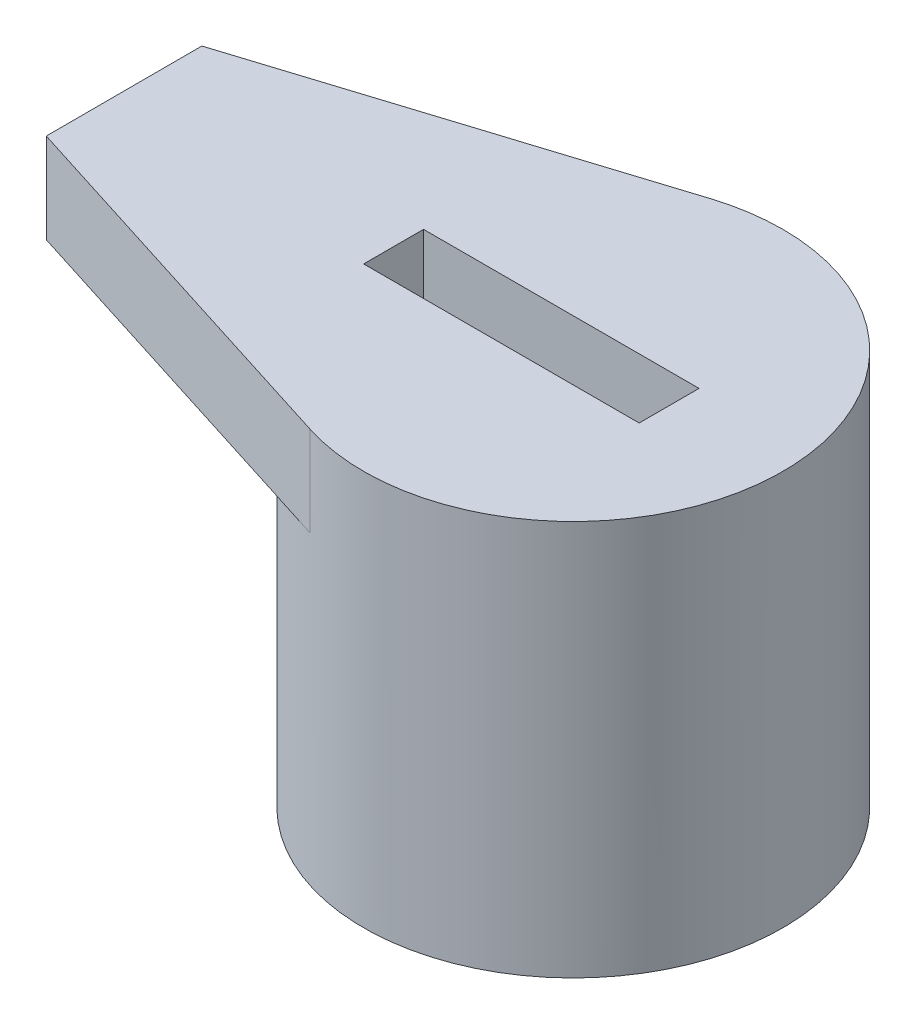
ISO-10303-21;
HEADER;
FILE_DESCRIPTION(('STEP AP214'),'2;1');
FILE_NAME('part.step','',(''),(''),'','','');
FILE_SCHEMA(('AUTOMOTIVE_DESIGN { 1 0 10303 214 1 1 1 1 }'));
ENDSEC;
DATA;
#1=APPLICATION_CONTEXT('core data for automotive mechanical design processes');
#2=APPLICATION_PROTOCOL_DEFINITION('international standard','automotive_design',2000,#1);
#3=PRODUCT_CONTEXT('',#1,'mechanical');
#4=PRODUCT('Part','Part','',(#3));
#5=PRODUCT_RELATED_PRODUCT_CATEGORY('part','',(#4));
#6=PRODUCT_DEFINITION_FORMATION('','',#4);
#7=PRODUCT_DEFINITION_CONTEXT('part definition',#1,'design');
#8=PRODUCT_DEFINITION('design','',#6,#7);
#9=PRODUCT_DEFINITION_SHAPE('','',#8);
#10=(LENGTH_UNIT() NAMED_UNIT(*) SI_UNIT(.MILLI.,.METRE.));
#11=(NAMED_UNIT(*) PLANE_ANGLE_UNIT() SI_UNIT($,.RADIAN.));
#12=(NAMED_UNIT(*) SI_UNIT($,.STERADIAN.) SOLID_ANGLE_UNIT());
#13=UNCERTAINTY_MEASURE_WITH_UNIT(LENGTH_MEASURE(1.E-05),#10,'distance_accuracy_value','');
#14=(GEOMETRIC_REPRESENTATION_CONTEXT(3) GLOBAL_UNCERTAINTY_ASSIGNED_CONTEXT((#13)) GLOBAL_UNIT_ASSIGNED_CONTEXT((#10,
#11,#12)) REPRESENTATION_CONTEXT('',''));
#15=CARTESIAN_POINT('',(0.,0.,0.));
#16=DIRECTION('',(0.,0.,1.));
#17=DIRECTION('',(1.,0.,0.));
#18=AXIS2_PLACEMENT_3D('',#15,#16,#17);
#19=CARTESIAN_POINT('',(-5.86092041698449,20.9504195270786,-34.));
#20=DIRECTION('',(0.,1.,0.));
#21=DIRECTION('',(0.,0.,1.));
#22=AXIS2_PLACEMENT_3D('',#19,#20,#21);
#23=PLANE('',#22);
#24=DIRECTION('',(0.,0.,-1.));
#25=VECTOR('',#24,1.);
#26=CARTESIAN_POINT('',(-4.26092041698449,20.9504195270786,-33.5));
#27=LINE('',#26,#25);
#28=CARTESIAN_POINT('',(-4.26092041698449,20.9504195270786,-33.5));
#29=VERTEX_POINT('',#28);
#30=CARTESIAN_POINT('',(-4.26092041698449,20.9504195270786,-34.5));
#31=VERTEX_POINT('',#30);
#32=EDGE_CURVE('E93',#29,#31,#27,.T.);
#33=ORIENTED_EDGE('',*,*,#32,.T.);
#34=DIRECTION('',(-1.,0.,0.));
#35=VECTOR('',#34,1.);
#36=CARTESIAN_POINT('',(-4.26092041698449,20.9504195270786,-34.5));
#37=LINE('',#36,#35);
#38=CARTESIAN_POINT('',(-8.86092041698449,20.9504195270786,-34.5));
#39=VERTEX_POINT('',#38);
#40=EDGE_CURVE('E95',#31,#39,#37,.T.);
#41=ORIENTED_EDGE('',*,*,#40,.T.);
#42=DIRECTION('',(0.,0.,1.));
#43=VECTOR('',#42,1.);
#44=CARTESIAN_POINT('',(-8.86092041698449,20.9504195270786,-33.5));
#45=LINE('',#44,#43);
#46=CARTESIAN_POINT('',(-8.86092041698449,20.9504195270786,-33.5));
#47=VERTEX_POINT('',#46);
#48=EDGE_CURVE('E97',#39,#47,#45,.T.);
#49=ORIENTED_EDGE('',*,*,#48,.T.);
#50=DIRECTION('',(1.,0.,0.));
#51=VECTOR('',#50,1.);
#52=CARTESIAN_POINT('',(-4.26092041698449,20.9504195270786,-33.5));
#53=LINE('',#52,#51);
#54=EDGE_CURVE('E168',#47,#29,#53,.T.);
#55=ORIENTED_EDGE('',*,*,#54,.T.);
#56=EDGE_LOOP('',(#33,#41,#49,#55));
#57=FACE_BOUND('',#56,.T.);
#58=ADVANCED_FACE('F18',(#57),#23,.T.);
#59=CARTESIAN_POINT('',(-8.86092041698449,20.9504195270786,-33.5));
#60=DIRECTION('',(-1.,0.,0.));
#61=DIRECTION('',(0.,0.,1.));
#62=AXIS2_PLACEMENT_3D('',#59,#60,#61);
#63=PLANE('',#62);
#64=ORIENTED_EDGE('',*,*,#48,.F.);
#65=DIRECTION('',(0.,1.,0.));
#66=VECTOR('',#65,1.);
#67=CARTESIAN_POINT('',(-8.86092041698449,20.9504195270786,-34.5));
#68=LINE('',#67,#66);
#69=CARTESIAN_POINT('',(-8.86092041698449,22.4504195270786,-34.5));
#70=VERTEX_POINT('',#69);
#71=EDGE_CURVE('E102',#39,#70,#68,.T.);
#72=ORIENTED_EDGE('',*,*,#71,.T.);
#73=DIRECTION('',(0.,0.,1.));
#74=VECTOR('',#73,1.);
#75=CARTESIAN_POINT('',(-8.86092041698449,22.4504195270786,-34.));
#76=LINE('',#75,#74);
#77=CARTESIAN_POINT('',(-8.86092041698449,22.4504195270786,-33.5));
#78=VERTEX_POINT('',#77);
#79=EDGE_CURVE('E78',#78,#70,#76,.F.);
#80=ORIENTED_EDGE('',*,*,#79,.F.);
#81=DIRECTION('',(0.,-1.,0.));
#82=VECTOR('',#81,1.);
#83=CARTESIAN_POINT('',(-8.86092041698449,20.9504195270786,-33.5));
#84=LINE('',#83,#82);
#85=EDGE_CURVE('E106',#78,#47,#84,.T.);
#86=ORIENTED_EDGE('',*,*,#85,.T.);
#87=EDGE_LOOP('',(#64,#72,#80,#86));
#88=FACE_BOUND('',#87,.T.);
#89=ADVANCED_FACE('F104',(#88),#63,.F.);
#90=CARTESIAN_POINT('',(-4.26092041698449,20.9504195270786,-34.5));
#91=DIRECTION('',(0.,0.,-1.));
#92=DIRECTION('',(-1.,0.,0.));
#93=AXIS2_PLACEMENT_3D('',#90,#91,#92);
#94=PLANE('',#93);
#95=ORIENTED_EDGE('',*,*,#40,.F.);
#96=DIRECTION('',(0.,1.,0.));
#97=VECTOR('',#96,1.);
#98=CARTESIAN_POINT('',(-4.26092041698449,20.9504195270786,-34.5));
#99=LINE('',#98,#97);
#100=CARTESIAN_POINT('',(-4.26092041698449,22.4504195270786,-34.5));
#101=VERTEX_POINT('',#100);
#102=EDGE_CURVE('E113',#31,#101,#99,.T.);
#103=ORIENTED_EDGE('',*,*,#102,.T.);
#104=DIRECTION('',(1.,0.,0.));
#105=VECTOR('',#104,1.);
#106=CARTESIAN_POINT('',(-5.86092041698449,22.4504195270786,-34.5));
#107=LINE('',#106,#105);
#108=EDGE_CURVE('E111',#70,#101,#107,.T.);
#109=ORIENTED_EDGE('',*,*,#108,.F.);
#110=ORIENTED_EDGE('',*,*,#71,.F.);
#111=EDGE_LOOP('',(#95,#103,#109,#110));
#112=FACE_BOUND('',#111,.T.);
#113=ADVANCED_FACE('F109',(#112),#94,.F.);
#114=CARTESIAN_POINT('',(-4.26092041698449,20.9504195270786,-33.5));
#115=DIRECTION('',(1.,0.,0.));
#116=DIRECTION('',(0.,0.,-1.));
#117=AXIS2_PLACEMENT_3D('',#114,#115,#116);
#118=PLANE('',#117);
#119=ORIENTED_EDGE('',*,*,#32,.F.);
#120=DIRECTION('',(0.,-1.,0.));
#121=VECTOR('',#120,1.);
#122=CARTESIAN_POINT('',(-4.26092041698449,20.9504195270786,-33.5));
#123=LINE('',#122,#121);
#124=CARTESIAN_POINT('',(-4.26092041698449,22.4504195270786,-33.5));
#125=VERTEX_POINT('',#124);
#126=EDGE_CURVE('E164',#29,#125,#123,.F.);
#127=ORIENTED_EDGE('',*,*,#126,.T.);
#128=DIRECTION('',(0.,0.,1.));
#129=VECTOR('',#128,1.);
#130=CARTESIAN_POINT('',(-4.26092041698449,22.4504195270786,-34.));
#131=LINE('',#130,#129);
#132=EDGE_CURVE('E141',#101,#125,#131,.T.);
#133=ORIENTED_EDGE('',*,*,#132,.F.);
#134=ORIENTED_EDGE('',*,*,#102,.F.);
#135=EDGE_LOOP('',(#119,#127,#133,#134));
#136=FACE_BOUND('',#135,.T.);
#137=ADVANCED_FACE('F172',(#136),#118,.F.);
#138=CARTESIAN_POINT('',(-4.26092041698449,20.9504195270786,-33.5));
#139=DIRECTION('',(0.,0.,1.));
#140=DIRECTION('',(0.,-1.,0.));
#141=AXIS2_PLACEMENT_3D('',#138,#139,#140);
#142=PLANE('',#141);
#143=ORIENTED_EDGE('',*,*,#54,.F.);
#144=ORIENTED_EDGE('',*,*,#85,.F.);
#145=DIRECTION('',(1.,0.,0.));
#146=VECTOR('',#145,1.);
#147=CARTESIAN_POINT('',(-5.86092041698449,22.4504195270786,-33.5));
#148=LINE('',#147,#146);
#149=EDGE_CURVE('E138',#125,#78,#148,.F.);
#150=ORIENTED_EDGE('',*,*,#149,.F.);
#151=ORIENTED_EDGE('',*,*,#126,.F.);
#152=EDGE_LOOP('',(#143,#144,#150,#151));
#153=FACE_BOUND('',#152,.T.);
#154=ADVANCED_FACE('F179',(#153),#142,.F.);
#155=CARTESIAN_POINT('',(-13.3593221713242,22.4504195270786,-32.7));
#156=DIRECTION('',(0.999999238856131,0.,-0.00123381001756133));
#157=DIRECTION('',(-0.00123381001756133,0.,-0.999999238856131));
#158=AXIS2_PLACEMENT_3D('',#155,#156,#157);
#159=PLANE('',#158);
#160=DIRECTION('',(0.00123381001756254,0.,0.999999238856131));
#161=VECTOR('',#160,1.);
#162=CARTESIAN_POINT('',(-13.3625300798115,22.4504195270786,-35.3));
#163=LINE('',#162,#161);
#164=CARTESIAN_POINT('',(-13.3625300798115,22.4504195270786,-35.3));
#165=VERTEX_POINT('',#164);
#166=CARTESIAN_POINT('',(-13.3593221713242,22.4504195270786,-32.7));
#167=VERTEX_POINT('',#166);
#168=EDGE_CURVE('E117',#165,#167,#163,.T.);
#169=ORIENTED_EDGE('',*,*,#168,.F.);
#170=DIRECTION('',(0.,1.,0.));
#171=VECTOR('',#170,1.);
#172=CARTESIAN_POINT('',(-13.3625300798115,22.4504195270786,-35.3));
#173=LINE('',#172,#171);
#174=CARTESIAN_POINT('',(-13.3625300798115,20.9504195270786,-35.3));
#175=VERTEX_POINT('',#174);
#176=EDGE_CURVE('E57',#165,#175,#173,.F.);
#177=ORIENTED_EDGE('',*,*,#176,.T.);
#178=DIRECTION('',(0.00123381001756255,0.,0.999999238856131));
#179=VECTOR('',#178,1.);
#180=CARTESIAN_POINT('',(-13.3625300798115,20.9504195270786,-35.3));
#181=LINE('',#180,#179);
#182=CARTESIAN_POINT('',(-13.3593221713242,20.9504195270786,-32.7));
#183=VERTEX_POINT('',#182);
#184=EDGE_CURVE('E51',#175,#183,#181,.T.);
#185=ORIENTED_EDGE('',*,*,#184,.T.);
#186=DIRECTION('',(0.,1.,0.));
#187=VECTOR('',#186,1.);
#188=CARTESIAN_POINT('',(-13.3593221713242,22.4504195270786,-32.7));
#189=LINE('',#188,#187);
#190=EDGE_CURVE('E69',#183,#167,#189,.T.);
#191=ORIENTED_EDGE('',*,*,#190,.T.);
#192=EDGE_LOOP('',(#169,#177,#185,#191));
#193=FACE_BOUND('',#192,.T.);
#194=ADVANCED_FACE('F181',(#193),#159,.F.);
#195=CARTESIAN_POINT('',(-13.3593221713242,22.4504195270786,-32.7));
#196=DIRECTION('',(0.301461317205613,0.,-0.95347840784606));
#197=DIRECTION('',(-0.95347840784606,0.,-0.301461317205613));
#198=AXIS2_PLACEMENT_3D('',#195,#196,#197);
#199=PLANE('',#198);
#200=DIRECTION('',(0.95347840784606,0.,0.301461317205611));
#201=VECTOR('',#200,1.);
#202=CARTESIAN_POINT('',(-13.3593221713242,22.4504195270786,-32.7));
#203=LINE('',#202,#201);
#204=CARTESIAN_POINT('',(-6.91603502720413,22.4504195270786,-30.6628255725388));
#205=VERTEX_POINT('',#204);
#206=EDGE_CURVE('E120',#167,#205,#203,.T.);
#207=ORIENTED_EDGE('',*,*,#206,.F.);
#208=ORIENTED_EDGE('',*,*,#190,.F.);
#209=DIRECTION('',(0.95347840784606,0.,0.301461317205611));
#210=VECTOR('',#209,1.);
#211=CARTESIAN_POINT('',(-13.3593221713242,20.9504195270786,-32.7));
#212=LINE('',#211,#210);
#213=CARTESIAN_POINT('',(-6.91603502720413,20.9504195270786,-30.6628255725388));
#214=VERTEX_POINT('',#213);
#215=EDGE_CURVE('E128',#183,#214,#212,.T.);
#216=ORIENTED_EDGE('',*,*,#215,.T.);
#217=DIRECTION('',(0.,1.,0.));
#218=VECTOR('',#217,1.);
#219=CARTESIAN_POINT('',(-6.91603502720414,22.4504195270786,-30.6628255725388));
#220=LINE('',#219,#218);
#221=EDGE_CURVE('E35',#205,#214,#220,.F.);
#222=ORIENTED_EDGE('',*,*,#221,.F.);
#223=EDGE_LOOP('',(#207,#208,#216,#222));
#224=FACE_BOUND('',#223,.T.);
#225=ADVANCED_FACE('F188',(#224),#199,.F.);
#226=CARTESIAN_POINT('',(-13.3625300798115,22.4504195270786,-35.3));
#227=DIRECTION('',(0.301324932706972,0.,0.953521517811286));
#228=DIRECTION('',(0.953521517811286,0.,-0.301324932706972));
#229=AXIS2_PLACEMENT_3D('',#226,#227,#228);
#230=PLANE('',#229);
#231=DIRECTION('',(-0.953521517811285,0.,0.301324932706974));
#232=VECTOR('',#231,1.);
#233=CARTESIAN_POINT('',(-6.91555768145889,22.4504195270786,-37.3373253123395));
#234=LINE('',#233,#232);
#235=CARTESIAN_POINT('',(-6.91555768145889,22.4504195270786,-37.3373253123395));
#236=VERTEX_POINT('',#235);
#237=EDGE_CURVE('E121',#236,#165,#234,.T.);
#238=ORIENTED_EDGE('',*,*,#237,.F.);
#239=DIRECTION('',(0.,-1.,0.));
#240=VECTOR('',#239,1.);
#241=CARTESIAN_POINT('',(-6.91555768145889,15.8504195270786,-37.3373253123395));
#242=LINE('',#241,#240);
#243=CARTESIAN_POINT('',(-6.9155576814589,20.9504195270786,-37.3373253123395));
#244=VERTEX_POINT('',#243);
#245=EDGE_CURVE('E152',#244,#236,#242,.F.);
#246=ORIENTED_EDGE('',*,*,#245,.F.);
#247=DIRECTION('',(-0.953521517811285,0.,0.301324932706975));
#248=VECTOR('',#247,1.);
#249=CARTESIAN_POINT('',(-6.91555768145889,20.9504195270786,-37.3373253123395));
#250=LINE('',#249,#248);
#251=EDGE_CURVE('E125',#244,#175,#250,.T.);
#252=ORIENTED_EDGE('',*,*,#251,.T.);
#253=ORIENTED_EDGE('',*,*,#176,.F.);
#254=EDGE_LOOP('',(#238,#246,#252,#253));
#255=FACE_BOUND('',#254,.T.);
#256=ADVANCED_FACE('F205',(#255),#230,.F.);
#257=CARTESIAN_POINT('',(-5.86092041698449,15.8504195270786,-34.));
#258=DIRECTION('',(0.,1.,0.));
#259=DIRECTION('',(0.,0.,1.));
#260=AXIS2_PLACEMENT_3D('',#257,#258,#259);
#261=PLANE('',#260);
#262=CARTESIAN_POINT('',(-5.86092041698449,15.8504195270786,-34.));
#263=DIRECTION('',(0.,-1.,0.));
#264=DIRECTION('',(0.,0.,-1.));
#265=AXIS2_PLACEMENT_3D('',#262,#263,#264);
#266=CIRCLE('',#265,3.5);
#267=CARTESIAN_POINT('',(-5.86092041698449,15.8504195270786,-37.5));
#268=VERTEX_POINT('',#267);
#269=EDGE_CURVE('E21',#268,#268,#266,.F.);
#270=ORIENTED_EDGE('',*,*,#269,.F.);
#271=EDGE_LOOP('',(#270));
#272=FACE_BOUND('',#271,.T.);
#273=ADVANCED_FACE('F202',(#272),#261,.F.);
#274=CARTESIAN_POINT('',(-5.86092041698449,22.4504195270786,-34.));
#275=DIRECTION('',(0.,1.,0.));
#276=DIRECTION('',(0.,0.,1.));
#277=AXIS2_PLACEMENT_3D('',#274,#275,#276);
#278=PLANE('',#277);
#279=ORIENTED_EDGE('',*,*,#132,.T.);
#280=ORIENTED_EDGE('',*,*,#149,.T.);
#281=ORIENTED_EDGE('',*,*,#79,.T.);
#282=ORIENTED_EDGE('',*,*,#108,.T.);
#283=EDGE_LOOP('',(#279,#280,#281,#282));
#284=FACE_BOUND('',#283,.T.);
#285=CARTESIAN_POINT('',(-5.86092041698449,22.4504195270786,-34.));
#286=DIRECTION('',(0.,-1.,0.));
#287=DIRECTION('',(0.,0.,-1.));
#288=AXIS2_PLACEMENT_3D('',#285,#286,#287);
#289=CIRCLE('',#288,3.5);
#290=EDGE_CURVE('E27',#236,#205,#289,.T.);
#291=ORIENTED_EDGE('',*,*,#290,.F.);
#292=ORIENTED_EDGE('',*,*,#237,.T.);
#293=ORIENTED_EDGE('',*,*,#168,.T.);
#294=ORIENTED_EDGE('',*,*,#206,.T.);
#295=EDGE_LOOP('',(#291,#292,#293,#294));
#296=FACE_BOUND('',#295,.T.);
#297=ADVANCED_FACE('F176',(#284,#296),#278,.T.);
#298=CARTESIAN_POINT('',(-5.86092041698449,20.9504195270786,-34.));
#299=DIRECTION('',(0.,1.,0.));
#300=DIRECTION('',(0.,0.,1.));
#301=AXIS2_PLACEMENT_3D('',#298,#299,#300);
#302=PLANE('',#301);
#303=ORIENTED_EDGE('',*,*,#251,.F.);
#304=CARTESIAN_POINT('',(-5.86092041698449,20.9504195270786,-34.));
#305=DIRECTION('',(0.,-1.,0.));
#306=DIRECTION('',(0.,0.,-1.));
#307=AXIS2_PLACEMENT_3D('',#304,#305,#306);
#308=CIRCLE('',#307,3.5);
#309=EDGE_CURVE('E11',#214,#244,#308,.T.);
#310=ORIENTED_EDGE('',*,*,#309,.F.);
#311=ORIENTED_EDGE('',*,*,#215,.F.);
#312=ORIENTED_EDGE('',*,*,#184,.F.);
#313=EDGE_LOOP('',(#303,#310,#311,#312));
#314=FACE_BOUND('',#313,.T.);
#315=ADVANCED_FACE('F193',(#314),#302,.F.);
#316=CARTESIAN_POINT('',(-5.86092041698449,15.8504195270786,-34.));
#317=DIRECTION('',(0.,-1.,0.));
#318=DIRECTION('',(0.,0.,-1.));
#319=AXIS2_PLACEMENT_3D('',#316,#317,#318);
#320=CYLINDRICAL_SURFACE('',#319,3.5);
#321=ORIENTED_EDGE('',*,*,#269,.T.);
#322=EDGE_LOOP('',(#321));
#323=FACE_BOUND('',#322,.T.);
#324=ORIENTED_EDGE('',*,*,#221,.T.);
#325=ORIENTED_EDGE('',*,*,#309,.T.);
#326=ORIENTED_EDGE('',*,*,#245,.T.);
#327=ORIENTED_EDGE('',*,*,#290,.T.);
#328=EDGE_LOOP('',(#324,#325,#326,#327));
#329=FACE_BOUND('',#328,.T.);
#330=ADVANCED_FACE('F191',(#323,#329),#320,.T.);
#331=CLOSED_SHELL('',(#58,#89,#113,#137,#154,#194,#225,#256,#273,#297,#315,#330));
#332=MANIFOLD_SOLID_BREP('B1',#331);
#333=ADVANCED_BREP_SHAPE_REPRESENTATION('',(#18,#332),#14);
#334=SHAPE_DEFINITION_REPRESENTATION(#9,#333);
ENDSEC;
END-ISO-10303-21;
